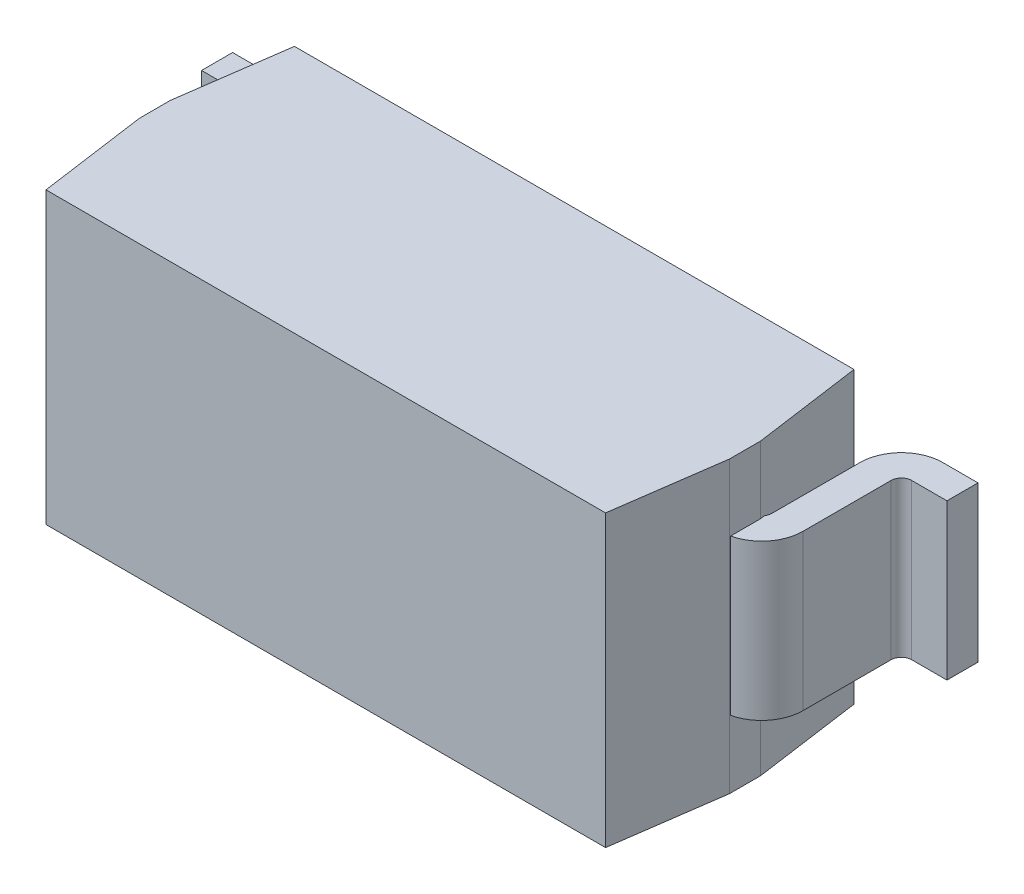
ISO-10303-21;
HEADER;
FILE_DESCRIPTION(('STEP AP214'),'2;1');
FILE_NAME('part.step','',(''),(''),'','','');
FILE_SCHEMA(('AUTOMOTIVE_DESIGN { 1 0 10303 214 1 1 1 1 }'));
ENDSEC;
DATA;
#1=APPLICATION_CONTEXT('core data for automotive mechanical design processes');
#2=APPLICATION_PROTOCOL_DEFINITION('international standard','automotive_design',2000,#1);
#3=PRODUCT_CONTEXT('',#1,'mechanical');
#4=PRODUCT('Part','Part','',(#3));
#5=PRODUCT_RELATED_PRODUCT_CATEGORY('part','',(#4));
#6=PRODUCT_DEFINITION_FORMATION('','',#4);
#7=PRODUCT_DEFINITION_CONTEXT('part definition',#1,'design');
#8=PRODUCT_DEFINITION('design','',#6,#7);
#9=PRODUCT_DEFINITION_SHAPE('','',#8);
#10=(LENGTH_UNIT() NAMED_UNIT(*) SI_UNIT(.MILLI.,.METRE.));
#11=(NAMED_UNIT(*) PLANE_ANGLE_UNIT() SI_UNIT($,.RADIAN.));
#12=(NAMED_UNIT(*) SI_UNIT($,.STERADIAN.) SOLID_ANGLE_UNIT());
#13=UNCERTAINTY_MEASURE_WITH_UNIT(LENGTH_MEASURE(1.E-05),#10,'distance_accuracy_value','');
#14=(GEOMETRIC_REPRESENTATION_CONTEXT(3) GLOBAL_UNCERTAINTY_ASSIGNED_CONTEXT((#13)) GLOBAL_UNIT_ASSIGNED_CONTEXT((#10,
#11,#12)) REPRESENTATION_CONTEXT('',''));
#15=CARTESIAN_POINT('',(0.,0.,0.));
#16=DIRECTION('',(0.,0.,1.));
#17=DIRECTION('',(1.,0.,0.));
#18=AXIS2_PLACEMENT_3D('',#15,#16,#17);
#19=CARTESIAN_POINT('',(-1.425,-0.375,0.825));
#20=DIRECTION('',(0.,-1.,0.));
#21=DIRECTION('',(0.,0.,-1.));
#22=AXIS2_PLACEMENT_3D('',#19,#20,#21);
#23=PLANE('',#22);
#24=DIRECTION('',(0.139173100960065,0.,-0.99026806874157));
#25=VECTOR('',#24,1.);
#26=CARTESIAN_POINT('',(-1.41689041628845,-0.375,0.617297313597687));
#27=LINE('',#26,#25);
#28=CARTESIAN_POINT('',(-1.425,-0.375,0.675));
#29=VERTEX_POINT('',#28);
#30=CARTESIAN_POINT('',(-1.42182380177004,-0.375,0.652400175282287));
#31=VERTEX_POINT('',#30);
#32=EDGE_CURVE('E290',#29,#31,#27,.T.);
#33=ORIENTED_EDGE('',*,*,#32,.F.);
#34=DIRECTION('',(0.,0.,-1.));
#35=VECTOR('',#34,1.);
#36=CARTESIAN_POINT('',(-1.425,-0.375,0.7875));
#37=LINE('',#36,#35);
#38=CARTESIAN_POINT('',(-1.425,-0.375,0.819871752699051));
#39=VERTEX_POINT('',#38);
#40=EDGE_CURVE('E323',#39,#29,#37,.T.);
#41=ORIENTED_EDGE('',*,*,#40,.F.);
#42=CARTESIAN_POINT('',(-1.38,-0.375,0.625));
#43=DIRECTION('',(0.,-1.,0.));
#44=DIRECTION('',(-1.,0.,0.));
#45=AXIS2_PLACEMENT_3D('',#42,#43,#44);
#46=CIRCLE('',#45,0.2);
#47=CARTESIAN_POINT('',(-1.58,-0.375,0.625));
#48=VERTEX_POINT('',#47);
#49=EDGE_CURVE('E11',#39,#48,#46,.T.);
#50=ORIENTED_EDGE('',*,*,#49,.T.);
#51=DIRECTION('',(0.,0.,-1.));
#52=VECTOR('',#51,1.);
#53=CARTESIAN_POINT('',(-1.58,-0.375,0.625));
#54=LINE('',#53,#52);
#55=CARTESIAN_POINT('',(-1.58,-0.375,0.2));
#56=VERTEX_POINT('',#55);
#57=EDGE_CURVE('E358',#48,#56,#54,.T.);
#58=ORIENTED_EDGE('',*,*,#57,.T.);
#59=CARTESIAN_POINT('',(-1.63,-0.375,0.2));
#60=DIRECTION('',(0.,1.,0.));
#61=DIRECTION('',(-1.,0.,0.));
#62=AXIS2_PLACEMENT_3D('',#59,#60,#61);
#63=CIRCLE('',#62,0.05);
#64=CARTESIAN_POINT('',(-1.63,-0.375,0.15));
#65=VERTEX_POINT('',#64);
#66=EDGE_CURVE('E447',#56,#65,#63,.T.);
#67=ORIENTED_EDGE('',*,*,#66,.T.);
#68=DIRECTION('',(-1.,0.,0.));
#69=VECTOR('',#68,1.);
#70=CARTESIAN_POINT('',(-1.63,-0.375,0.15));
#71=LINE('',#70,#69);
#72=CARTESIAN_POINT('',(-1.8,-0.375,0.15));
#73=VERTEX_POINT('',#72);
#74=EDGE_CURVE('E314',#65,#73,#71,.T.);
#75=ORIENTED_EDGE('',*,*,#74,.T.);
#76=DIRECTION('',(0.,0.,-1.));
#77=VECTOR('',#76,1.);
#78=CARTESIAN_POINT('',(-1.8,-0.375,0.15));
#79=LINE('',#78,#77);
#80=CARTESIAN_POINT('',(-1.8,-0.375,0.));
#81=VERTEX_POINT('',#80);
#82=EDGE_CURVE('E340',#73,#81,#79,.T.);
#83=ORIENTED_EDGE('',*,*,#82,.T.);
#84=DIRECTION('',(1.,0.,0.));
#85=VECTOR('',#84,1.);
#86=CARTESIAN_POINT('',(-1.8,-0.375,0.));
#87=LINE('',#86,#85);
#88=CARTESIAN_POINT('',(-1.63,-0.375,0.));
#89=VERTEX_POINT('',#88);
#90=EDGE_CURVE('E300',#81,#89,#87,.T.);
#91=ORIENTED_EDGE('',*,*,#90,.T.);
#92=CARTESIAN_POINT('',(-1.63,-0.375,0.2));
#93=DIRECTION('',(0.,-1.,0.));
#94=DIRECTION('',(-1.,0.,0.));
#95=AXIS2_PLACEMENT_3D('',#92,#93,#94);
#96=CIRCLE('',#95,0.2);
#97=CARTESIAN_POINT('',(-1.43,-0.375,0.2));
#98=VERTEX_POINT('',#97);
#99=EDGE_CURVE('E262',#89,#98,#96,.T.);
#100=ORIENTED_EDGE('',*,*,#99,.T.);
#101=DIRECTION('',(0.,0.,1.));
#102=VECTOR('',#101,1.);
#103=CARTESIAN_POINT('',(-1.43,-0.375,0.2));
#104=LINE('',#103,#102);
#105=CARTESIAN_POINT('',(-1.43,-0.375,0.625));
#106=VERTEX_POINT('',#105);
#107=EDGE_CURVE('E406',#98,#106,#104,.T.);
#108=ORIENTED_EDGE('',*,*,#107,.T.);
#109=CARTESIAN_POINT('',(-1.38,-0.375,0.625));
#110=DIRECTION('',(0.,1.,0.));
#111=DIRECTION('',(-1.,0.,0.));
#112=AXIS2_PLACEMENT_3D('',#109,#110,#111);
#113=CIRCLE('',#112,0.05);
#114=EDGE_CURVE('E433',#106,#31,#113,.T.);
#115=ORIENTED_EDGE('',*,*,#114,.T.);
#116=EDGE_LOOP('',(#33,#41,#50,#58,#67,#75,#83,#91,#100,#108,#115));
#117=FACE_BOUND('',#116,.T.);
#118=ADVANCED_FACE('F16',(#117),#23,.T.);
#119=CARTESIAN_POINT('',(-1.38,-0.375,0.625));
#120=DIRECTION('',(0.,1.,0.));
#121=DIRECTION('',(-1.,0.,0.));
#122=AXIS2_PLACEMENT_3D('',#119,#120,#121);
#123=CYLINDRICAL_SURFACE('',#122,0.2);
#124=ORIENTED_EDGE('',*,*,#49,.F.);
#125=DIRECTION('',(0.,1.,0.));
#126=VECTOR('',#125,1.);
#127=CARTESIAN_POINT('',(-1.425,-0.375,0.819871752699051));
#128=LINE('',#127,#126);
#129=CARTESIAN_POINT('',(-1.425,0.375,0.819871752699051));
#130=VERTEX_POINT('',#129);
#131=EDGE_CURVE('E319',#39,#130,#128,.T.);
#132=ORIENTED_EDGE('',*,*,#131,.T.);
#133=CARTESIAN_POINT('',(-1.38,0.375,0.625));
#134=DIRECTION('',(0.,1.,0.));
#135=DIRECTION('',(-1.,0.,0.));
#136=AXIS2_PLACEMENT_3D('',#133,#134,#135);
#137=CIRCLE('',#136,0.2);
#138=CARTESIAN_POINT('',(-1.58,0.375,0.625));
#139=VERTEX_POINT('',#138);
#140=EDGE_CURVE('E429',#139,#130,#137,.T.);
#141=ORIENTED_EDGE('',*,*,#140,.F.);
#142=DIRECTION('',(0.,1.,0.));
#143=VECTOR('',#142,1.);
#144=CARTESIAN_POINT('',(-1.58,-0.375,0.625));
#145=LINE('',#144,#143);
#146=EDGE_CURVE('E27',#48,#139,#145,.T.);
#147=ORIENTED_EDGE('',*,*,#146,.F.);
#148=EDGE_LOOP('',(#124,#132,#141,#147));
#149=FACE_BOUND('',#148,.T.);
#150=ADVANCED_FACE('F705',(#149),#123,.T.);
#151=CARTESIAN_POINT('',(-1.58,-0.375,0.2));
#152=DIRECTION('',(-1.,0.,0.));
#153=DIRECTION('',(0.,1.,0.));
#154=AXIS2_PLACEMENT_3D('',#151,#152,#153);
#155=PLANE('',#154);
#156=ORIENTED_EDGE('',*,*,#57,.F.);
#157=ORIENTED_EDGE('',*,*,#146,.T.);
#158=DIRECTION('',(0.,0.,1.));
#159=VECTOR('',#158,1.);
#160=CARTESIAN_POINT('',(-1.58,0.375,0.625));
#161=LINE('',#160,#159);
#162=CARTESIAN_POINT('',(-1.58,0.375,0.2));
#163=VERTEX_POINT('',#162);
#164=EDGE_CURVE('E405',#163,#139,#161,.T.);
#165=ORIENTED_EDGE('',*,*,#164,.F.);
#166=DIRECTION('',(0.,1.,0.));
#167=VECTOR('',#166,1.);
#168=CARTESIAN_POINT('',(-1.58,-0.375,0.2));
#169=LINE('',#168,#167);
#170=EDGE_CURVE('E469',#56,#163,#169,.T.);
#171=ORIENTED_EDGE('',*,*,#170,.F.);
#172=EDGE_LOOP('',(#156,#157,#165,#171));
#173=FACE_BOUND('',#172,.T.);
#174=ADVANCED_FACE('F710',(#173),#155,.T.);
#175=CARTESIAN_POINT('',(-1.63,-0.375,0.2));
#176=DIRECTION('',(0.,1.,0.));
#177=DIRECTION('',(-1.,0.,0.));
#178=AXIS2_PLACEMENT_3D('',#175,#176,#177);
#179=CYLINDRICAL_SURFACE('',#178,0.05);
#180=ORIENTED_EDGE('',*,*,#66,.F.);
#181=ORIENTED_EDGE('',*,*,#170,.T.);
#182=CARTESIAN_POINT('',(-1.63,0.375,0.2));
#183=DIRECTION('',(0.,-1.,0.));
#184=DIRECTION('',(-1.,0.,0.));
#185=AXIS2_PLACEMENT_3D('',#182,#183,#184);
#186=CIRCLE('',#185,0.05);
#187=CARTESIAN_POINT('',(-1.63,0.375,0.15));
#188=VERTEX_POINT('',#187);
#189=EDGE_CURVE('E288',#188,#163,#186,.T.);
#190=ORIENTED_EDGE('',*,*,#189,.F.);
#191=DIRECTION('',(0.,1.,0.));
#192=VECTOR('',#191,1.);
#193=CARTESIAN_POINT('',(-1.63,-0.375,0.15));
#194=LINE('',#193,#192);
#195=EDGE_CURVE('E316',#65,#188,#194,.T.);
#196=ORIENTED_EDGE('',*,*,#195,.F.);
#197=EDGE_LOOP('',(#180,#181,#190,#196));
#198=FACE_BOUND('',#197,.T.);
#199=ADVANCED_FACE('F649',(#198),#179,.F.);
#200=CARTESIAN_POINT('',(-1.8,-0.375,0.15));
#201=DIRECTION('',(0.,0.,1.));
#202=DIRECTION('',(0.,-1.,0.));
#203=AXIS2_PLACEMENT_3D('',#200,#201,#202);
#204=PLANE('',#203);
#205=ORIENTED_EDGE('',*,*,#74,.F.);
#206=ORIENTED_EDGE('',*,*,#195,.T.);
#207=DIRECTION('',(1.,0.,0.));
#208=VECTOR('',#207,1.);
#209=CARTESIAN_POINT('',(-1.63,0.375,0.15));
#210=LINE('',#209,#208);
#211=CARTESIAN_POINT('',(-1.8,0.375,0.15));
#212=VERTEX_POINT('',#211);
#213=EDGE_CURVE('E284',#212,#188,#210,.T.);
#214=ORIENTED_EDGE('',*,*,#213,.F.);
#215=DIRECTION('',(0.,1.,0.));
#216=VECTOR('',#215,1.);
#217=CARTESIAN_POINT('',(-1.8,-0.375,0.15));
#218=LINE('',#217,#216);
#219=EDGE_CURVE('E317',#73,#212,#218,.T.);
#220=ORIENTED_EDGE('',*,*,#219,.F.);
#221=EDGE_LOOP('',(#205,#206,#214,#220));
#222=FACE_BOUND('',#221,.T.);
#223=ADVANCED_FACE('F644',(#222),#204,.T.);
#224=CARTESIAN_POINT('',(-1.8,-0.375,0.));
#225=DIRECTION('',(-1.,0.,0.));
#226=DIRECTION('',(0.,1.,0.));
#227=AXIS2_PLACEMENT_3D('',#224,#225,#226);
#228=PLANE('',#227);
#229=ORIENTED_EDGE('',*,*,#82,.F.);
#230=ORIENTED_EDGE('',*,*,#219,.T.);
#231=DIRECTION('',(0.,0.,1.));
#232=VECTOR('',#231,1.);
#233=CARTESIAN_POINT('',(-1.8,0.375,0.15));
#234=LINE('',#233,#232);
#235=CARTESIAN_POINT('',(-1.8,0.375,0.));
#236=VERTEX_POINT('',#235);
#237=EDGE_CURVE('E289',#236,#212,#234,.T.);
#238=ORIENTED_EDGE('',*,*,#237,.F.);
#239=DIRECTION('',(0.,1.,0.));
#240=VECTOR('',#239,1.);
#241=CARTESIAN_POINT('',(-1.8,-0.375,0.));
#242=LINE('',#241,#240);
#243=EDGE_CURVE('E411',#81,#236,#242,.T.);
#244=ORIENTED_EDGE('',*,*,#243,.F.);
#245=EDGE_LOOP('',(#229,#230,#238,#244));
#246=FACE_BOUND('',#245,.T.);
#247=ADVANCED_FACE('F737',(#246),#228,.T.);
#248=CARTESIAN_POINT('',(-1.63,-0.375,0.));
#249=DIRECTION('',(0.,0.,-1.));
#250=DIRECTION('',(0.,-1.,0.));
#251=AXIS2_PLACEMENT_3D('',#248,#249,#250);
#252=PLANE('',#251);
#253=ORIENTED_EDGE('',*,*,#90,.F.);
#254=ORIENTED_EDGE('',*,*,#243,.T.);
#255=DIRECTION('',(-1.,0.,0.));
#256=VECTOR('',#255,1.);
#257=CARTESIAN_POINT('',(-1.8,0.375,0.));
#258=LINE('',#257,#256);
#259=CARTESIAN_POINT('',(-1.63,0.375,0.));
#260=VERTEX_POINT('',#259);
#261=EDGE_CURVE('E333',#260,#236,#258,.T.);
#262=ORIENTED_EDGE('',*,*,#261,.F.);
#263=DIRECTION('',(0.,1.,0.));
#264=VECTOR('',#263,1.);
#265=CARTESIAN_POINT('',(-1.63,-0.375,0.));
#266=LINE('',#265,#264);
#267=EDGE_CURVE('E266',#89,#260,#266,.T.);
#268=ORIENTED_EDGE('',*,*,#267,.F.);
#269=EDGE_LOOP('',(#253,#254,#262,#268));
#270=FACE_BOUND('',#269,.T.);
#271=ADVANCED_FACE('F730',(#270),#252,.T.);
#272=CARTESIAN_POINT('',(-1.63,-0.375,0.2));
#273=DIRECTION('',(0.,1.,0.));
#274=DIRECTION('',(-1.,0.,0.));
#275=AXIS2_PLACEMENT_3D('',#272,#273,#274);
#276=CYLINDRICAL_SURFACE('',#275,0.2);
#277=ORIENTED_EDGE('',*,*,#99,.F.);
#278=ORIENTED_EDGE('',*,*,#267,.T.);
#279=CARTESIAN_POINT('',(-1.63,0.375,0.2));
#280=DIRECTION('',(0.,1.,0.));
#281=DIRECTION('',(-1.,0.,0.));
#282=AXIS2_PLACEMENT_3D('',#279,#280,#281);
#283=CIRCLE('',#282,0.2);
#284=CARTESIAN_POINT('',(-1.43,0.375,0.2));
#285=VERTEX_POINT('',#284);
#286=EDGE_CURVE('E20',#285,#260,#283,.T.);
#287=ORIENTED_EDGE('',*,*,#286,.F.);
#288=DIRECTION('',(0.,1.,0.));
#289=VECTOR('',#288,1.);
#290=CARTESIAN_POINT('',(-1.43,-0.375,0.2));
#291=LINE('',#290,#289);
#292=EDGE_CURVE('E267',#98,#285,#291,.T.);
#293=ORIENTED_EDGE('',*,*,#292,.F.);
#294=EDGE_LOOP('',(#277,#278,#287,#293));
#295=FACE_BOUND('',#294,.T.);
#296=ADVANCED_FACE('F727',(#295),#276,.T.);
#297=CARTESIAN_POINT('',(-1.43,-0.375,0.625));
#298=DIRECTION('',(1.,0.,0.));
#299=DIRECTION('',(0.,1.,0.));
#300=AXIS2_PLACEMENT_3D('',#297,#298,#299);
#301=PLANE('',#300);
#302=ORIENTED_EDGE('',*,*,#107,.F.);
#303=ORIENTED_EDGE('',*,*,#292,.T.);
#304=DIRECTION('',(0.,0.,-1.));
#305=VECTOR('',#304,1.);
#306=CARTESIAN_POINT('',(-1.43,0.375,0.2));
#307=LINE('',#306,#305);
#308=CARTESIAN_POINT('',(-1.43,0.375,0.625));
#309=VERTEX_POINT('',#308);
#310=EDGE_CURVE('E276',#309,#285,#307,.T.);
#311=ORIENTED_EDGE('',*,*,#310,.F.);
#312=DIRECTION('',(0.,1.,0.));
#313=VECTOR('',#312,1.);
#314=CARTESIAN_POINT('',(-1.43,-0.375,0.625));
#315=LINE('',#314,#313);
#316=EDGE_CURVE('E410',#106,#309,#315,.T.);
#317=ORIENTED_EDGE('',*,*,#316,.F.);
#318=EDGE_LOOP('',(#302,#303,#311,#317));
#319=FACE_BOUND('',#318,.T.);
#320=ADVANCED_FACE('F729',(#319),#301,.T.);
#321=CARTESIAN_POINT('',(-1.38,-0.375,0.625));
#322=DIRECTION('',(0.,1.,0.));
#323=DIRECTION('',(-1.,0.,0.));
#324=AXIS2_PLACEMENT_3D('',#321,#322,#323);
#325=CYLINDRICAL_SURFACE('',#324,0.05);
#326=DIRECTION('',(0.,1.,0.));
#327=VECTOR('',#326,1.);
#328=CARTESIAN_POINT('',(-1.42182380177004,-0.375,0.652400175282287));
#329=LINE('',#328,#327);
#330=CARTESIAN_POINT('',(-1.42182380177004,0.375,0.652400175282287));
#331=VERTEX_POINT('',#330);
#332=EDGE_CURVE('E294',#31,#331,#329,.T.);
#333=ORIENTED_EDGE('',*,*,#332,.F.);
#334=ORIENTED_EDGE('',*,*,#114,.F.);
#335=ORIENTED_EDGE('',*,*,#316,.T.);
#336=CARTESIAN_POINT('',(-1.38,0.375,0.625));
#337=DIRECTION('',(0.,-1.,0.));
#338=DIRECTION('',(-1.,0.,0.));
#339=AXIS2_PLACEMENT_3D('',#336,#337,#338);
#340=CIRCLE('',#339,0.05);
#341=EDGE_CURVE('E280',#331,#309,#340,.T.);
#342=ORIENTED_EDGE('',*,*,#341,.F.);
#343=EDGE_LOOP('',(#333,#334,#335,#342));
#344=FACE_BOUND('',#343,.T.);
#345=ADVANCED_FACE('F673',(#344),#325,.F.);
#346=CARTESIAN_POINT('',(-1.425,0.375,0.825));
#347=DIRECTION('',(0.,-1.,0.));
#348=DIRECTION('',(0.,0.,-1.));
#349=AXIS2_PLACEMENT_3D('',#346,#347,#348);
#350=PLANE('',#349);
#351=DIRECTION('',(-0.139173100960065,0.,0.99026806874157));
#352=VECTOR('',#351,1.);
#353=CARTESIAN_POINT('',(-1.41689041628845,0.375,0.617297313597687));
#354=LINE('',#353,#352);
#355=CARTESIAN_POINT('',(-1.425,0.375,0.675));
#356=VERTEX_POINT('',#355);
#357=EDGE_CURVE('E311',#331,#356,#354,.T.);
#358=ORIENTED_EDGE('',*,*,#357,.F.);
#359=ORIENTED_EDGE('',*,*,#341,.T.);
#360=ORIENTED_EDGE('',*,*,#310,.T.);
#361=ORIENTED_EDGE('',*,*,#286,.T.);
#362=ORIENTED_EDGE('',*,*,#261,.T.);
#363=ORIENTED_EDGE('',*,*,#237,.T.);
#364=ORIENTED_EDGE('',*,*,#213,.T.);
#365=ORIENTED_EDGE('',*,*,#189,.T.);
#366=ORIENTED_EDGE('',*,*,#164,.T.);
#367=ORIENTED_EDGE('',*,*,#140,.T.);
#368=DIRECTION('',(0.,0.,1.));
#369=VECTOR('',#368,1.);
#370=CARTESIAN_POINT('',(-1.425,0.375,0.7875));
#371=LINE('',#370,#369);
#372=EDGE_CURVE('E324',#356,#130,#371,.T.);
#373=ORIENTED_EDGE('',*,*,#372,.F.);
#374=EDGE_LOOP('',(#358,#359,#360,#361,#362,#363,#364,#365,#366,#367,#373));
#375=FACE_BOUND('',#374,.T.);
#376=ADVANCED_FACE('F654',(#375),#350,.F.);
#377=CARTESIAN_POINT('',(-1.38810803089062,0.,0.4125));
#378=DIRECTION('',(-0.99026806874157,0.,-0.139173100960065));
#379=DIRECTION('',(-0.139173100960065,0.,0.99026806874157));
#380=AXIS2_PLACEMENT_3D('',#377,#378,#379);
#381=PLANE('',#380);
#382=ORIENTED_EDGE('',*,*,#32,.T.);
#383=ORIENTED_EDGE('',*,*,#332,.T.);
#384=ORIENTED_EDGE('',*,*,#357,.T.);
#385=DIRECTION('',(0.,1.,0.));
#386=VECTOR('',#385,1.);
#387=CARTESIAN_POINT('',(-1.425,0.,0.675));
#388=LINE('',#387,#386);
#389=CARTESIAN_POINT('',(-1.425,0.7,0.675));
#390=VERTEX_POINT('',#389);
#391=EDGE_CURVE('E418',#356,#390,#388,.T.);
#392=ORIENTED_EDGE('',*,*,#391,.T.);
#393=DIRECTION('',(0.139173100960065,0.,-0.99026806874157));
#394=VECTOR('',#393,1.);
#395=CARTESIAN_POINT('',(-1.39792169504491,0.7,0.482327848789038));
#396=LINE('',#395,#394);
#397=CARTESIAN_POINT('',(-1.35121606178124,0.7,0.15));
#398=VERTEX_POINT('',#397);
#399=EDGE_CURVE('E381',#390,#398,#396,.T.);
#400=ORIENTED_EDGE('',*,*,#399,.T.);
#401=DIRECTION('',(0.,-1.,0.));
#402=VECTOR('',#401,1.);
#403=CARTESIAN_POINT('',(-1.35121606178124,0.,0.15));
#404=LINE('',#403,#402);
#405=CARTESIAN_POINT('',(-1.35121606178124,-0.7,0.15));
#406=VERTEX_POINT('',#405);
#407=EDGE_CURVE('E297',#398,#406,#404,.T.);
#408=ORIENTED_EDGE('',*,*,#407,.T.);
#409=DIRECTION('',(-0.139173100960065,0.,0.99026806874157));
#410=VECTOR('',#409,1.);
#411=CARTESIAN_POINT('',(-1.39792169504491,-0.7,0.482327848789038));
#412=LINE('',#411,#410);
#413=CARTESIAN_POINT('',(-1.425,-0.7,0.675));
#414=VERTEX_POINT('',#413);
#415=EDGE_CURVE('E227',#406,#414,#412,.T.);
#416=ORIENTED_EDGE('',*,*,#415,.T.);
#417=DIRECTION('',(0.,1.,0.));
#418=VECTOR('',#417,1.);
#419=CARTESIAN_POINT('',(-1.425,0.,0.675));
#420=LINE('',#419,#418);
#421=EDGE_CURVE('E365',#414,#29,#420,.T.);
#422=ORIENTED_EDGE('',*,*,#421,.T.);
#423=EDGE_LOOP('',(#382,#383,#384,#392,#400,#408,#416,#422));
#424=FACE_BOUND('',#423,.T.);
#425=ADVANCED_FACE('F543',(#424),#381,.T.);
#426=CARTESIAN_POINT('',(1.425,0.375,0.825));
#427=DIRECTION('',(0.,1.,0.));
#428=DIRECTION('',(0.,0.,-1.));
#429=AXIS2_PLACEMENT_3D('',#426,#427,#428);
#430=PLANE('',#429);
#431=DIRECTION('',(-0.139173100960066,0.,-0.99026806874157));
#432=VECTOR('',#431,1.);
#433=CARTESIAN_POINT('',(1.41689041628845,0.375,0.617297313597687));
#434=LINE('',#433,#432);
#435=CARTESIAN_POINT('',(1.425,0.375,0.675));
#436=VERTEX_POINT('',#435);
#437=CARTESIAN_POINT('',(1.42182380177004,0.375,0.652400175282287));
#438=VERTEX_POINT('',#437);
#439=EDGE_CURVE('E226',#436,#438,#434,.T.);
#440=ORIENTED_EDGE('',*,*,#439,.F.);
#441=DIRECTION('',(0.,0.,-1.));
#442=VECTOR('',#441,1.);
#443=CARTESIAN_POINT('',(1.425,0.375,0.7875));
#444=LINE('',#443,#442);
#445=CARTESIAN_POINT('',(1.425,0.375,0.819871752699051));
#446=VERTEX_POINT('',#445);
#447=EDGE_CURVE('E351',#446,#436,#444,.T.);
#448=ORIENTED_EDGE('',*,*,#447,.F.);
#449=CARTESIAN_POINT('',(1.38,0.375,0.625));
#450=DIRECTION('',(0.,1.,0.));
#451=DIRECTION('',(1.,0.,0.));
#452=AXIS2_PLACEMENT_3D('',#449,#450,#451);
#453=CIRCLE('',#452,0.2);
#454=CARTESIAN_POINT('',(1.58,0.375,0.625));
#455=VERTEX_POINT('',#454);
#456=EDGE_CURVE('E100',#446,#455,#453,.T.);
#457=ORIENTED_EDGE('',*,*,#456,.T.);
#458=DIRECTION('',(0.,0.,-1.));
#459=VECTOR('',#458,1.);
#460=CARTESIAN_POINT('',(1.58,0.375,0.625));
#461=LINE('',#460,#459);
#462=CARTESIAN_POINT('',(1.58,0.375,0.2));
#463=VERTEX_POINT('',#462);
#464=EDGE_CURVE('E436',#455,#463,#461,.T.);
#465=ORIENTED_EDGE('',*,*,#464,.T.);
#466=CARTESIAN_POINT('',(1.63,0.375,0.2));
#467=DIRECTION('',(0.,-1.,0.));
#468=DIRECTION('',(1.,0.,0.));
#469=AXIS2_PLACEMENT_3D('',#466,#467,#468);
#470=CIRCLE('',#469,0.05);
#471=CARTESIAN_POINT('',(1.63,0.375,0.15));
#472=VERTEX_POINT('',#471);
#473=EDGE_CURVE('E397',#463,#472,#470,.T.);
#474=ORIENTED_EDGE('',*,*,#473,.T.);
#475=DIRECTION('',(1.,0.,0.));
#476=VECTOR('',#475,1.);
#477=CARTESIAN_POINT('',(1.63,0.375,0.15));
#478=LINE('',#477,#476);
#479=CARTESIAN_POINT('',(1.8,0.375,0.15));
#480=VERTEX_POINT('',#479);
#481=EDGE_CURVE('E255',#472,#480,#478,.T.);
#482=ORIENTED_EDGE('',*,*,#481,.T.);
#483=DIRECTION('',(0.,0.,-1.));
#484=VECTOR('',#483,1.);
#485=CARTESIAN_POINT('',(1.8,0.375,0.15));
#486=LINE('',#485,#484);
#487=CARTESIAN_POINT('',(1.8,0.375,0.));
#488=VERTEX_POINT('',#487);
#489=EDGE_CURVE('E332',#480,#488,#486,.T.);
#490=ORIENTED_EDGE('',*,*,#489,.T.);
#491=DIRECTION('',(-1.,0.,0.));
#492=VECTOR('',#491,1.);
#493=CARTESIAN_POINT('',(1.8,0.375,0.));
#494=LINE('',#493,#492);
#495=CARTESIAN_POINT('',(1.63,0.375,0.));
#496=VERTEX_POINT('',#495);
#497=EDGE_CURVE('E341',#488,#496,#494,.T.);
#498=ORIENTED_EDGE('',*,*,#497,.T.);
#499=CARTESIAN_POINT('',(1.63,0.375,0.2));
#500=DIRECTION('',(0.,1.,0.));
#501=DIRECTION('',(1.,0.,0.));
#502=AXIS2_PLACEMENT_3D('',#499,#500,#501);
#503=CIRCLE('',#502,0.2);
#504=CARTESIAN_POINT('',(1.43,0.375,0.2));
#505=VERTEX_POINT('',#504);
#506=EDGE_CURVE('E377',#496,#505,#503,.T.);
#507=ORIENTED_EDGE('',*,*,#506,.T.);
#508=DIRECTION('',(0.,0.,1.));
#509=VECTOR('',#508,1.);
#510=CARTESIAN_POINT('',(1.43,0.375,0.2));
#511=LINE('',#510,#509);
#512=CARTESIAN_POINT('',(1.43,0.375,0.625));
#513=VERTEX_POINT('',#512);
#514=EDGE_CURVE('E388',#505,#513,#511,.T.);
#515=ORIENTED_EDGE('',*,*,#514,.T.);
#516=CARTESIAN_POINT('',(1.38,0.375,0.625));
#517=DIRECTION('',(0.,-1.,0.));
#518=DIRECTION('',(1.,0.,0.));
#519=AXIS2_PLACEMENT_3D('',#516,#517,#518);
#520=CIRCLE('',#519,0.05);
#521=EDGE_CURVE('E500',#513,#438,#520,.T.);
#522=ORIENTED_EDGE('',*,*,#521,.T.);
#523=EDGE_LOOP('',(#440,#448,#457,#465,#474,#482,#490,#498,#507,#515,#522));
#524=FACE_BOUND('',#523,.T.);
#525=ADVANCED_FACE('F618',(#524),#430,.T.);
#526=CARTESIAN_POINT('',(1.38,0.375,0.625));
#527=DIRECTION('',(0.,-1.,0.));
#528=DIRECTION('',(1.,0.,0.));
#529=AXIS2_PLACEMENT_3D('',#526,#527,#528);
#530=CYLINDRICAL_SURFACE('',#529,0.2);
#531=ORIENTED_EDGE('',*,*,#456,.F.);
#532=DIRECTION('',(0.,-1.,0.));
#533=VECTOR('',#532,1.);
#534=CARTESIAN_POINT('',(1.425,0.375,0.819871752699051));
#535=LINE('',#534,#533);
#536=CARTESIAN_POINT('',(1.425,-0.375,0.819871752699051));
#537=VERTEX_POINT('',#536);
#538=EDGE_CURVE('E310',#446,#537,#535,.T.);
#539=ORIENTED_EDGE('',*,*,#538,.T.);
#540=CARTESIAN_POINT('',(1.38,-0.375,0.625));
#541=DIRECTION('',(0.,-1.,0.));
#542=DIRECTION('',(1.,0.,0.));
#543=AXIS2_PLACEMENT_3D('',#540,#541,#542);
#544=CIRCLE('',#543,0.2);
#545=CARTESIAN_POINT('',(1.58,-0.375,0.625));
#546=VERTEX_POINT('',#545);
#547=EDGE_CURVE('E116',#546,#537,#544,.T.);
#548=ORIENTED_EDGE('',*,*,#547,.F.);
#549=DIRECTION('',(0.,-1.,0.));
#550=VECTOR('',#549,1.);
#551=CARTESIAN_POINT('',(1.58,0.375,0.625));
#552=LINE('',#551,#550);
#553=EDGE_CURVE('E303',#455,#546,#552,.T.);
#554=ORIENTED_EDGE('',*,*,#553,.F.);
#555=EDGE_LOOP('',(#531,#539,#548,#554));
#556=FACE_BOUND('',#555,.T.);
#557=ADVANCED_FACE('F607',(#556),#530,.T.);
#558=CARTESIAN_POINT('',(1.58,0.375,0.2));
#559=DIRECTION('',(1.,0.,0.));
#560=DIRECTION('',(0.,1.,0.));
#561=AXIS2_PLACEMENT_3D('',#558,#559,#560);
#562=PLANE('',#561);
#563=ORIENTED_EDGE('',*,*,#464,.F.);
#564=ORIENTED_EDGE('',*,*,#553,.T.);
#565=DIRECTION('',(0.,0.,1.));
#566=VECTOR('',#565,1.);
#567=CARTESIAN_POINT('',(1.58,-0.375,0.625));
#568=LINE('',#567,#566);
#569=CARTESIAN_POINT('',(1.58,-0.375,0.2));
#570=VERTEX_POINT('',#569);
#571=EDGE_CURVE('E359',#570,#546,#568,.T.);
#572=ORIENTED_EDGE('',*,*,#571,.F.);
#573=DIRECTION('',(0.,-1.,0.));
#574=VECTOR('',#573,1.);
#575=CARTESIAN_POINT('',(1.58,0.375,0.2));
#576=LINE('',#575,#574);
#577=EDGE_CURVE('E400',#463,#570,#576,.T.);
#578=ORIENTED_EDGE('',*,*,#577,.F.);
#579=EDGE_LOOP('',(#563,#564,#572,#578));
#580=FACE_BOUND('',#579,.T.);
#581=ADVANCED_FACE('F605',(#580),#562,.T.);
#582=CARTESIAN_POINT('',(1.63,0.375,0.2));
#583=DIRECTION('',(0.,-1.,0.));
#584=DIRECTION('',(1.,0.,0.));
#585=AXIS2_PLACEMENT_3D('',#582,#583,#584);
#586=CYLINDRICAL_SURFACE('',#585,0.05);
#587=ORIENTED_EDGE('',*,*,#473,.F.);
#588=ORIENTED_EDGE('',*,*,#577,.T.);
#589=CARTESIAN_POINT('',(1.63,-0.375,0.2));
#590=DIRECTION('',(0.,1.,0.));
#591=DIRECTION('',(1.,0.,0.));
#592=AXIS2_PLACEMENT_3D('',#589,#590,#591);
#593=CIRCLE('',#592,0.05);
#594=CARTESIAN_POINT('',(1.63,-0.375,0.15));
#595=VERTEX_POINT('',#594);
#596=EDGE_CURVE('E260',#595,#570,#593,.T.);
#597=ORIENTED_EDGE('',*,*,#596,.F.);
#598=DIRECTION('',(0.,-1.,0.));
#599=VECTOR('',#598,1.);
#600=CARTESIAN_POINT('',(1.63,0.375,0.15));
#601=LINE('',#600,#599);
#602=EDGE_CURVE('E401',#472,#595,#601,.T.);
#603=ORIENTED_EDGE('',*,*,#602,.F.);
#604=EDGE_LOOP('',(#587,#588,#597,#603));
#605=FACE_BOUND('',#604,.T.);
#606=ADVANCED_FACE('F615',(#605),#586,.F.);
#607=CARTESIAN_POINT('',(1.8,0.375,0.15));
#608=DIRECTION('',(0.,0.,1.));
#609=DIRECTION('',(0.,-1.,0.));
#610=AXIS2_PLACEMENT_3D('',#607,#608,#609);
#611=PLANE('',#610);
#612=ORIENTED_EDGE('',*,*,#481,.F.);
#613=ORIENTED_EDGE('',*,*,#602,.T.);
#614=DIRECTION('',(-1.,0.,0.));
#615=VECTOR('',#614,1.);
#616=CARTESIAN_POINT('',(1.63,-0.375,0.15));
#617=LINE('',#616,#615);
#618=CARTESIAN_POINT('',(1.8,-0.375,0.15));
#619=VERTEX_POINT('',#618);
#620=EDGE_CURVE('E257',#619,#595,#617,.T.);
#621=ORIENTED_EDGE('',*,*,#620,.F.);
#622=DIRECTION('',(0.,-1.,0.));
#623=VECTOR('',#622,1.);
#624=CARTESIAN_POINT('',(1.8,0.375,0.15));
#625=LINE('',#624,#623);
#626=EDGE_CURVE('E329',#480,#619,#625,.T.);
#627=ORIENTED_EDGE('',*,*,#626,.F.);
#628=EDGE_LOOP('',(#612,#613,#621,#627));
#629=FACE_BOUND('',#628,.T.);
#630=ADVANCED_FACE('F722',(#629),#611,.T.);
#631=CARTESIAN_POINT('',(1.8,0.375,0.));
#632=DIRECTION('',(1.,0.,0.));
#633=DIRECTION('',(0.,1.,0.));
#634=AXIS2_PLACEMENT_3D('',#631,#632,#633);
#635=PLANE('',#634);
#636=ORIENTED_EDGE('',*,*,#489,.F.);
#637=ORIENTED_EDGE('',*,*,#626,.T.);
#638=DIRECTION('',(0.,0.,1.));
#639=VECTOR('',#638,1.);
#640=CARTESIAN_POINT('',(1.8,-0.375,0.15));
#641=LINE('',#640,#639);
#642=CARTESIAN_POINT('',(1.8,-0.375,0.));
#643=VERTEX_POINT('',#642);
#644=EDGE_CURVE('E261',#643,#619,#641,.T.);
#645=ORIENTED_EDGE('',*,*,#644,.F.);
#646=DIRECTION('',(0.,-1.,0.));
#647=VECTOR('',#646,1.);
#648=CARTESIAN_POINT('',(1.8,0.375,0.));
#649=LINE('',#648,#647);
#650=EDGE_CURVE('E344',#488,#643,#649,.T.);
#651=ORIENTED_EDGE('',*,*,#650,.F.);
#652=EDGE_LOOP('',(#636,#637,#645,#651));
#653=FACE_BOUND('',#652,.T.);
#654=ADVANCED_FACE('F718',(#653),#635,.T.);
#655=CARTESIAN_POINT('',(1.63,0.375,0.));
#656=DIRECTION('',(0.,0.,-1.));
#657=DIRECTION('',(0.,-1.,0.));
#658=AXIS2_PLACEMENT_3D('',#655,#656,#657);
#659=PLANE('',#658);
#660=ORIENTED_EDGE('',*,*,#497,.F.);
#661=ORIENTED_EDGE('',*,*,#650,.T.);
#662=DIRECTION('',(1.,0.,0.));
#663=VECTOR('',#662,1.);
#664=CARTESIAN_POINT('',(1.8,-0.375,0.));
#665=LINE('',#664,#663);
#666=CARTESIAN_POINT('',(1.63,-0.375,0.));
#667=VERTEX_POINT('',#666);
#668=EDGE_CURVE('E474',#667,#643,#665,.T.);
#669=ORIENTED_EDGE('',*,*,#668,.F.);
#670=DIRECTION('',(0.,-1.,0.));
#671=VECTOR('',#670,1.);
#672=CARTESIAN_POINT('',(1.63,0.375,0.));
#673=LINE('',#672,#671);
#674=EDGE_CURVE('E345',#496,#667,#673,.T.);
#675=ORIENTED_EDGE('',*,*,#674,.F.);
#676=EDGE_LOOP('',(#660,#661,#669,#675));
#677=FACE_BOUND('',#676,.T.);
#678=ADVANCED_FACE('F721',(#677),#659,.T.);
#679=CARTESIAN_POINT('',(1.63,0.375,0.2));
#680=DIRECTION('',(0.,-1.,0.));
#681=DIRECTION('',(1.,0.,0.));
#682=AXIS2_PLACEMENT_3D('',#679,#680,#681);
#683=CYLINDRICAL_SURFACE('',#682,0.2);
#684=ORIENTED_EDGE('',*,*,#506,.F.);
#685=ORIENTED_EDGE('',*,*,#674,.T.);
#686=CARTESIAN_POINT('',(1.63,-0.375,0.2));
#687=DIRECTION('',(0.,-1.,0.));
#688=DIRECTION('',(1.,0.,0.));
#689=AXIS2_PLACEMENT_3D('',#686,#687,#688);
#690=CIRCLE('',#689,0.2);
#691=CARTESIAN_POINT('',(1.43,-0.375,0.2));
#692=VERTEX_POINT('',#691);
#693=EDGE_CURVE('E470',#692,#667,#690,.T.);
#694=ORIENTED_EDGE('',*,*,#693,.F.);
#695=DIRECTION('',(0.,-1.,0.));
#696=VECTOR('',#695,1.);
#697=CARTESIAN_POINT('',(1.43,0.375,0.2));
#698=LINE('',#697,#696);
#699=EDGE_CURVE('E385',#505,#692,#698,.T.);
#700=ORIENTED_EDGE('',*,*,#699,.F.);
#701=EDGE_LOOP('',(#684,#685,#694,#700));
#702=FACE_BOUND('',#701,.T.);
#703=ADVANCED_FACE('F725',(#702),#683,.T.);
#704=CARTESIAN_POINT('',(1.43,0.375,0.625));
#705=DIRECTION('',(-1.,0.,0.));
#706=DIRECTION('',(0.,0.,1.));
#707=AXIS2_PLACEMENT_3D('',#704,#705,#706);
#708=PLANE('',#707);
#709=ORIENTED_EDGE('',*,*,#514,.F.);
#710=ORIENTED_EDGE('',*,*,#699,.T.);
#711=DIRECTION('',(0.,0.,-1.));
#712=VECTOR('',#711,1.);
#713=CARTESIAN_POINT('',(1.43,-0.375,0.2));
#714=LINE('',#713,#712);
#715=CARTESIAN_POINT('',(1.43,-0.375,0.625));
#716=VERTEX_POINT('',#715);
#717=EDGE_CURVE('E452',#716,#692,#714,.T.);
#718=ORIENTED_EDGE('',*,*,#717,.F.);
#719=DIRECTION('',(0.,-1.,0.));
#720=VECTOR('',#719,1.);
#721=CARTESIAN_POINT('',(1.43,0.375,0.625));
#722=LINE('',#721,#720);
#723=EDGE_CURVE('E497',#513,#716,#722,.T.);
#724=ORIENTED_EDGE('',*,*,#723,.F.);
#725=EDGE_LOOP('',(#709,#710,#718,#724));
#726=FACE_BOUND('',#725,.T.);
#727=ADVANCED_FACE('F956',(#726),#708,.T.);
#728=CARTESIAN_POINT('',(1.38,0.375,0.625));
#729=DIRECTION('',(0.,-1.,0.));
#730=DIRECTION('',(1.,0.,0.));
#731=AXIS2_PLACEMENT_3D('',#728,#729,#730);
#732=CYLINDRICAL_SURFACE('',#731,0.05);
#733=DIRECTION('',(0.,-1.,0.));
#734=VECTOR('',#733,1.);
#735=CARTESIAN_POINT('',(1.42182380177004,0.375,0.652400175282287));
#736=LINE('',#735,#734);
#737=CARTESIAN_POINT('',(1.42182380177004,-0.375,0.652400175282287));
#738=VERTEX_POINT('',#737);
#739=EDGE_CURVE('E273',#438,#738,#736,.T.);
#740=ORIENTED_EDGE('',*,*,#739,.F.);
#741=ORIENTED_EDGE('',*,*,#521,.F.);
#742=ORIENTED_EDGE('',*,*,#723,.T.);
#743=CARTESIAN_POINT('',(1.38,-0.375,0.625));
#744=DIRECTION('',(0.,1.,0.));
#745=DIRECTION('',(1.,0.,0.));
#746=AXIS2_PLACEMENT_3D('',#743,#744,#745);
#747=CIRCLE('',#746,0.05);
#748=EDGE_CURVE('E448',#738,#716,#747,.T.);
#749=ORIENTED_EDGE('',*,*,#748,.F.);
#750=EDGE_LOOP('',(#740,#741,#742,#749));
#751=FACE_BOUND('',#750,.T.);
#752=ADVANCED_FACE('F18',(#751),#732,.F.);
#753=CARTESIAN_POINT('',(1.425,-0.375,0.825));
#754=DIRECTION('',(0.,1.,0.));
#755=DIRECTION('',(0.,0.,-1.));
#756=AXIS2_PLACEMENT_3D('',#753,#754,#755);
#757=PLANE('',#756);
#758=DIRECTION('',(0.139173100960066,0.,0.99026806874157));
#759=VECTOR('',#758,1.);
#760=CARTESIAN_POINT('',(1.41689041628845,-0.375,0.617297313597687));
#761=LINE('',#760,#759);
#762=CARTESIAN_POINT('',(1.425,-0.375,0.675));
#763=VERTEX_POINT('',#762);
#764=EDGE_CURVE('E235',#738,#763,#761,.T.);
#765=ORIENTED_EDGE('',*,*,#764,.F.);
#766=ORIENTED_EDGE('',*,*,#748,.T.);
#767=ORIENTED_EDGE('',*,*,#717,.T.);
#768=ORIENTED_EDGE('',*,*,#693,.T.);
#769=ORIENTED_EDGE('',*,*,#668,.T.);
#770=ORIENTED_EDGE('',*,*,#644,.T.);
#771=ORIENTED_EDGE('',*,*,#620,.T.);
#772=ORIENTED_EDGE('',*,*,#596,.T.);
#773=ORIENTED_EDGE('',*,*,#571,.T.);
#774=ORIENTED_EDGE('',*,*,#547,.T.);
#775=DIRECTION('',(0.,0.,1.));
#776=VECTOR('',#775,1.);
#777=CARTESIAN_POINT('',(1.425,-0.375,0.7875));
#778=LINE('',#777,#776);
#779=EDGE_CURVE('E239',#763,#537,#778,.T.);
#780=ORIENTED_EDGE('',*,*,#779,.F.);
#781=EDGE_LOOP('',(#765,#766,#767,#768,#769,#770,#771,#772,#773,#774,#780));
#782=FACE_BOUND('',#781,.T.);
#783=ADVANCED_FACE('F609',(#782),#757,.F.);
#784=CARTESIAN_POINT('',(1.38810803089062,0.,0.4125));
#785=DIRECTION('',(0.99026806874157,0.,-0.139173100960066));
#786=DIRECTION('',(0.,-1.,0.));
#787=AXIS2_PLACEMENT_3D('',#784,#785,#786);
#788=PLANE('',#787);
#789=ORIENTED_EDGE('',*,*,#439,.T.);
#790=ORIENTED_EDGE('',*,*,#739,.T.);
#791=ORIENTED_EDGE('',*,*,#764,.T.);
#792=DIRECTION('',(0.,-1.,0.));
#793=VECTOR('',#792,1.);
#794=CARTESIAN_POINT('',(1.425,0.,0.675));
#795=LINE('',#794,#793);
#796=CARTESIAN_POINT('',(1.425,-0.7,0.675));
#797=VERTEX_POINT('',#796);
#798=EDGE_CURVE('E230',#763,#797,#795,.T.);
#799=ORIENTED_EDGE('',*,*,#798,.T.);
#800=DIRECTION('',(-0.139173100960066,0.,-0.99026806874157));
#801=VECTOR('',#800,1.);
#802=CARTESIAN_POINT('',(1.39792169504491,-0.7,0.482327848789038));
#803=LINE('',#802,#801);
#804=CARTESIAN_POINT('',(1.35121606178124,-0.7,0.15));
#805=VERTEX_POINT('',#804);
#806=EDGE_CURVE('E211',#797,#805,#803,.T.);
#807=ORIENTED_EDGE('',*,*,#806,.T.);
#808=DIRECTION('',(0.,1.,0.));
#809=VECTOR('',#808,1.);
#810=CARTESIAN_POINT('',(1.35121606178124,0.,0.15));
#811=LINE('',#810,#809);
#812=CARTESIAN_POINT('',(1.35121606178124,0.7,0.15));
#813=VERTEX_POINT('',#812);
#814=EDGE_CURVE('E283',#805,#813,#811,.T.);
#815=ORIENTED_EDGE('',*,*,#814,.T.);
#816=DIRECTION('',(0.139173100960066,0.,0.99026806874157));
#817=VECTOR('',#816,1.);
#818=CARTESIAN_POINT('',(1.39792169504491,0.7,0.482327848789037));
#819=LINE('',#818,#817);
#820=CARTESIAN_POINT('',(1.425,0.7,0.675));
#821=VERTEX_POINT('',#820);
#822=EDGE_CURVE('E369',#813,#821,#819,.T.);
#823=ORIENTED_EDGE('',*,*,#822,.T.);
#824=DIRECTION('',(0.,-1.,0.));
#825=VECTOR('',#824,1.);
#826=CARTESIAN_POINT('',(1.425,0.,0.675));
#827=LINE('',#826,#825);
#828=EDGE_CURVE('E346',#821,#436,#827,.T.);
#829=ORIENTED_EDGE('',*,*,#828,.T.);
#830=EDGE_LOOP('',(#789,#790,#791,#799,#807,#815,#823,#829));
#831=FACE_BOUND('',#830,.T.);
#832=ADVANCED_FACE('F232',(#831),#788,.T.);
#833=CARTESIAN_POINT('',(0.,-0.7,0.75));
#834=DIRECTION('',(0.,-1.,0.));
#835=DIRECTION('',(-1.,0.,0.));
#836=AXIS2_PLACEMENT_3D('',#833,#834,#835);
#837=PLANE('',#836);
#838=ORIENTED_EDGE('',*,*,#415,.F.);
#839=DIRECTION('',(1.,0.,0.));
#840=VECTOR('',#839,1.);
#841=CARTESIAN_POINT('',(0.,-0.7,0.15));
#842=LINE('',#841,#840);
#843=EDGE_CURVE('E221',#406,#805,#842,.T.);
#844=ORIENTED_EDGE('',*,*,#843,.T.);
#845=ORIENTED_EDGE('',*,*,#806,.F.);
#846=DIRECTION('',(0.,0.,1.));
#847=VECTOR('',#846,1.);
#848=CARTESIAN_POINT('',(1.425,-0.7,0.75));
#849=LINE('',#848,#847);
#850=CARTESIAN_POINT('',(1.425,-0.7,0.825));
#851=VERTEX_POINT('',#850);
#852=EDGE_CURVE('E217',#797,#851,#849,.T.);
#853=ORIENTED_EDGE('',*,*,#852,.T.);
#854=DIRECTION('',(0.139173100960066,0.,-0.99026806874157));
#855=VECTOR('',#854,1.);
#856=CARTESIAN_POINT('',(1.39792169504491,-0.7,1.01767215121096));
#857=LINE('',#856,#855);
#858=CARTESIAN_POINT('',(1.35121606178124,-0.7,1.35));
#859=VERTEX_POINT('',#858);
#860=EDGE_CURVE('E268',#859,#851,#857,.T.);
#861=ORIENTED_EDGE('',*,*,#860,.F.);
#862=DIRECTION('',(-1.,0.,0.));
#863=VECTOR('',#862,1.);
#864=CARTESIAN_POINT('',(0.,-0.7,1.35));
#865=LINE('',#864,#863);
#866=CARTESIAN_POINT('',(-1.35121606178124,-0.7,1.35));
#867=VERTEX_POINT('',#866);
#868=EDGE_CURVE('E393',#859,#867,#865,.T.);
#869=ORIENTED_EDGE('',*,*,#868,.T.);
#870=DIRECTION('',(0.139173100960065,0.,0.99026806874157));
#871=VECTOR('',#870,1.);
#872=CARTESIAN_POINT('',(-1.39792169504491,-0.7,1.01767215121096));
#873=LINE('',#872,#871);
#874=CARTESIAN_POINT('',(-1.425,-0.7,0.825));
#875=VERTEX_POINT('',#874);
#876=EDGE_CURVE('E304',#875,#867,#873,.T.);
#877=ORIENTED_EDGE('',*,*,#876,.F.);
#878=DIRECTION('',(0.,0.,-1.));
#879=VECTOR('',#878,1.);
#880=CARTESIAN_POINT('',(-1.425,-0.7,0.75));
#881=LINE('',#880,#879);
#882=EDGE_CURVE('E373',#875,#414,#881,.T.);
#883=ORIENTED_EDGE('',*,*,#882,.T.);
#884=EDGE_LOOP('',(#838,#844,#845,#853,#861,#869,#877,#883));
#885=FACE_BOUND('',#884,.T.);
#886=ADVANCED_FACE('F214',(#885),#837,.T.);
#887=CARTESIAN_POINT('',(0.,0.,0.15));
#888=DIRECTION('',(0.,0.,1.));
#889=DIRECTION('',(0.,-1.,0.));
#890=AXIS2_PLACEMENT_3D('',#887,#888,#889);
#891=PLANE('',#890);
#892=ORIENTED_EDGE('',*,*,#407,.F.);
#893=DIRECTION('',(-1.,0.,0.));
#894=VECTOR('',#893,1.);
#895=CARTESIAN_POINT('',(0.,0.7,0.15));
#896=LINE('',#895,#894);
#897=EDGE_CURVE('E307',#813,#398,#896,.T.);
#898=ORIENTED_EDGE('',*,*,#897,.F.);
#899=ORIENTED_EDGE('',*,*,#814,.F.);
#900=ORIENTED_EDGE('',*,*,#843,.F.);
#901=EDGE_LOOP('',(#892,#898,#899,#900));
#902=FACE_BOUND('',#901,.T.);
#903=ADVANCED_FACE('F548',(#902),#891,.F.);
#904=CARTESIAN_POINT('',(-1.38810803089062,0.,1.0875));
#905=DIRECTION('',(-0.99026806874157,0.,0.139173100960065));
#906=DIRECTION('',(0.,1.,0.));
#907=AXIS2_PLACEMENT_3D('',#904,#905,#906);
#908=PLANE('',#907);
#909=DIRECTION('',(-0.139173100960065,0.,-0.99026806874157));
#910=VECTOR('',#909,1.);
#911=CARTESIAN_POINT('',(-1.39792169504491,0.7,1.01767215121096));
#912=LINE('',#911,#910);
#913=CARTESIAN_POINT('',(-1.35121606178124,0.7,1.35));
#914=VERTEX_POINT('',#913);
#915=CARTESIAN_POINT('',(-1.425,0.7,0.825));
#916=VERTEX_POINT('',#915);
#917=EDGE_CURVE('E378',#914,#916,#912,.T.);
#918=ORIENTED_EDGE('',*,*,#917,.T.);
#919=DIRECTION('',(0.,-1.,0.));
#920=VECTOR('',#919,1.);
#921=CARTESIAN_POINT('',(-1.425,0.,0.825));
#922=LINE('',#921,#920);
#923=EDGE_CURVE('E419',#916,#875,#922,.T.);
#924=ORIENTED_EDGE('',*,*,#923,.T.);
#925=ORIENTED_EDGE('',*,*,#876,.T.);
#926=DIRECTION('',(0.,1.,0.));
#927=VECTOR('',#926,1.);
#928=CARTESIAN_POINT('',(-1.35121606178124,0.,1.35));
#929=LINE('',#928,#927);
#930=EDGE_CURVE('E271',#867,#914,#929,.T.);
#931=ORIENTED_EDGE('',*,*,#930,.T.);
#932=EDGE_LOOP('',(#918,#924,#925,#931));
#933=FACE_BOUND('',#932,.T.);
#934=ADVANCED_FACE('F690',(#933),#908,.T.);
#935=CARTESIAN_POINT('',(0.,0.7,0.75));
#936=DIRECTION('',(0.,-1.,0.));
#937=DIRECTION('',(-1.,0.,0.));
#938=AXIS2_PLACEMENT_3D('',#935,#936,#937);
#939=PLANE('',#938);
#940=ORIENTED_EDGE('',*,*,#399,.F.);
#941=DIRECTION('',(0.,0.,1.));
#942=VECTOR('',#941,1.);
#943=CARTESIAN_POINT('',(-1.425,0.7,0.75));
#944=LINE('',#943,#942);
#945=EDGE_CURVE('E414',#390,#916,#944,.T.);
#946=ORIENTED_EDGE('',*,*,#945,.T.);
#947=ORIENTED_EDGE('',*,*,#917,.F.);
#948=DIRECTION('',(1.,0.,0.));
#949=VECTOR('',#948,1.);
#950=CARTESIAN_POINT('',(0.,0.7,1.35));
#951=LINE('',#950,#949);
#952=CARTESIAN_POINT('',(1.35121606178124,0.7,1.35));
#953=VERTEX_POINT('',#952);
#954=EDGE_CURVE('E389',#914,#953,#951,.T.);
#955=ORIENTED_EDGE('',*,*,#954,.T.);
#956=DIRECTION('',(-0.139173100960066,0.,0.99026806874157));
#957=VECTOR('',#956,1.);
#958=CARTESIAN_POINT('',(1.39792169504491,0.7,1.01767215121096));
#959=LINE('',#958,#957);
#960=CARTESIAN_POINT('',(1.425,0.7,0.825));
#961=VERTEX_POINT('',#960);
#962=EDGE_CURVE('E328',#961,#953,#959,.T.);
#963=ORIENTED_EDGE('',*,*,#962,.F.);
#964=DIRECTION('',(0.,0.,-1.));
#965=VECTOR('',#964,1.);
#966=CARTESIAN_POINT('',(1.425,0.7,0.75));
#967=LINE('',#966,#965);
#968=EDGE_CURVE('E350',#961,#821,#967,.T.);
#969=ORIENTED_EDGE('',*,*,#968,.T.);
#970=ORIENTED_EDGE('',*,*,#822,.F.);
#971=ORIENTED_EDGE('',*,*,#897,.T.);
#972=EDGE_LOOP('',(#940,#946,#947,#955,#963,#969,#970,#971));
#973=FACE_BOUND('',#972,.T.);
#974=ADVANCED_FACE('F551',(#973),#939,.F.);
#975=CARTESIAN_POINT('',(0.,0.,1.35));
#976=DIRECTION('',(0.,0.,-1.));
#977=DIRECTION('',(0.,-1.,0.));
#978=AXIS2_PLACEMENT_3D('',#975,#976,#977);
#979=PLANE('',#978);
#980=ORIENTED_EDGE('',*,*,#930,.F.);
#981=ORIENTED_EDGE('',*,*,#868,.F.);
#982=DIRECTION('',(0.,-1.,0.));
#983=VECTOR('',#982,1.);
#984=CARTESIAN_POINT('',(1.35121606178124,0.,1.35));
#985=LINE('',#984,#983);
#986=EDGE_CURVE('E272',#953,#859,#985,.T.);
#987=ORIENTED_EDGE('',*,*,#986,.F.);
#988=ORIENTED_EDGE('',*,*,#954,.F.);
#989=EDGE_LOOP('',(#980,#981,#987,#988));
#990=FACE_BOUND('',#989,.T.);
#991=ADVANCED_FACE('F689',(#990),#979,.F.);
#992=CARTESIAN_POINT('',(1.38810803089062,0.,1.0875));
#993=DIRECTION('',(0.99026806874157,0.,0.139173100960066));
#994=DIRECTION('',(0.,-1.,0.));
#995=AXIS2_PLACEMENT_3D('',#992,#993,#994);
#996=PLANE('',#995);
#997=ORIENTED_EDGE('',*,*,#962,.T.);
#998=ORIENTED_EDGE('',*,*,#986,.T.);
#999=ORIENTED_EDGE('',*,*,#860,.T.);
#1000=DIRECTION('',(0.,1.,0.));
#1001=VECTOR('',#1000,1.);
#1002=CARTESIAN_POINT('',(1.425,0.,0.825));
#1003=LINE('',#1002,#1001);
#1004=EDGE_CURVE('E244',#851,#961,#1003,.T.);
#1005=ORIENTED_EDGE('',*,*,#1004,.T.);
#1006=EDGE_LOOP('',(#997,#998,#999,#1005));
#1007=FACE_BOUND('',#1006,.T.);
#1008=ADVANCED_FACE('F692',(#1007),#996,.T.);
#1009=CARTESIAN_POINT('',(-1.425,0.,0.75));
#1010=DIRECTION('',(1.,0.,0.));
#1011=DIRECTION('',(0.,1.,0.));
#1012=AXIS2_PLACEMENT_3D('',#1009,#1010,#1011);
#1013=PLANE('',#1012);
#1014=ORIENTED_EDGE('',*,*,#923,.F.);
#1015=ORIENTED_EDGE('',*,*,#945,.F.);
#1016=ORIENTED_EDGE('',*,*,#391,.F.);
#1017=ORIENTED_EDGE('',*,*,#372,.T.);
#1018=ORIENTED_EDGE('',*,*,#131,.F.);
#1019=ORIENTED_EDGE('',*,*,#40,.T.);
#1020=ORIENTED_EDGE('',*,*,#421,.F.);
#1021=ORIENTED_EDGE('',*,*,#882,.F.);
#1022=EDGE_LOOP('',(#1014,#1015,#1016,#1017,#1018,#1019,#1020,#1021));
#1023=FACE_BOUND('',#1022,.T.);
#1024=ADVANCED_FACE('F682',(#1023),#1013,.F.);
#1025=CARTESIAN_POINT('',(1.425,0.,0.75));
#1026=DIRECTION('',(-1.,0.,0.));
#1027=DIRECTION('',(0.,0.,1.));
#1028=AXIS2_PLACEMENT_3D('',#1025,#1026,#1027);
#1029=PLANE('',#1028);
#1030=ORIENTED_EDGE('',*,*,#1004,.F.);
#1031=ORIENTED_EDGE('',*,*,#852,.F.);
#1032=ORIENTED_EDGE('',*,*,#798,.F.);
#1033=ORIENTED_EDGE('',*,*,#779,.T.);
#1034=ORIENTED_EDGE('',*,*,#538,.F.);
#1035=ORIENTED_EDGE('',*,*,#447,.T.);
#1036=ORIENTED_EDGE('',*,*,#828,.F.);
#1037=ORIENTED_EDGE('',*,*,#968,.F.);
#1038=EDGE_LOOP('',(#1030,#1031,#1032,#1033,#1034,#1035,#1036,#1037));
#1039=FACE_BOUND('',#1038,.T.);
#1040=ADVANCED_FACE('F241',(#1039),#1029,.F.);
#1041=CLOSED_SHELL('',(#118,#150,#174,#199,#223,#247,#271,#296,#320,#345,#376,#425,#525,#557,
#581,#606,#630,#654,#678,#703,#727,#752,#783,#832,#886,#903,#934,#974,#991,#1008,#1024,#1040));
#1042=MANIFOLD_SOLID_BREP('B1',#1041);
#1043=ADVANCED_BREP_SHAPE_REPRESENTATION('',(#18,#1042),#14);
#1044=SHAPE_DEFINITION_REPRESENTATION(#9,#1043);
ENDSEC;
END-ISO-10303-21;
